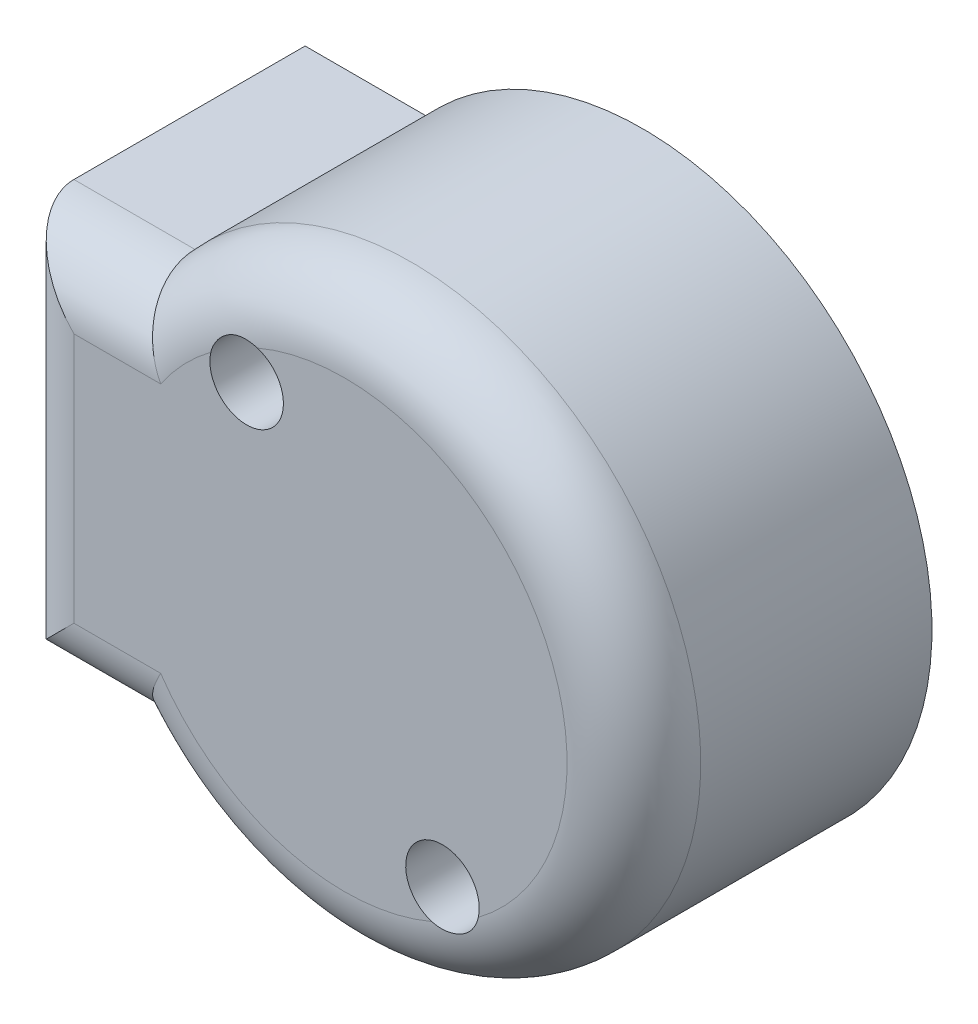
ISO-10303-21;
HEADER;
FILE_DESCRIPTION(('STEP AP214'),'2;1');
FILE_NAME('part.step','',(''),(''),'','','');
FILE_SCHEMA(('AUTOMOTIVE_DESIGN { 1 0 10303 214 1 1 1 1 }'));
ENDSEC;
DATA;
#1=APPLICATION_CONTEXT('core data for automotive mechanical design processes');
#2=APPLICATION_PROTOCOL_DEFINITION('international standard','automotive_design',2000,#1);
#3=PRODUCT_CONTEXT('',#1,'mechanical');
#4=PRODUCT('Part','Part','',(#3));
#5=PRODUCT_RELATED_PRODUCT_CATEGORY('part','',(#4));
#6=PRODUCT_DEFINITION_FORMATION('','',#4);
#7=PRODUCT_DEFINITION_CONTEXT('part definition',#1,'design');
#8=PRODUCT_DEFINITION('design','',#6,#7);
#9=PRODUCT_DEFINITION_SHAPE('','',#8);
#10=(LENGTH_UNIT() NAMED_UNIT(*) SI_UNIT(.MILLI.,.METRE.));
#11=(NAMED_UNIT(*) PLANE_ANGLE_UNIT() SI_UNIT($,.RADIAN.));
#12=(NAMED_UNIT(*) SI_UNIT($,.STERADIAN.) SOLID_ANGLE_UNIT());
#13=UNCERTAINTY_MEASURE_WITH_UNIT(LENGTH_MEASURE(1.E-05),#10,'distance_accuracy_value','');
#14=(GEOMETRIC_REPRESENTATION_CONTEXT(3) GLOBAL_UNCERTAINTY_ASSIGNED_CONTEXT((#13)) GLOBAL_UNIT_ASSIGNED_CONTEXT((#10,
#11,#12)) REPRESENTATION_CONTEXT('',''));
#15=CARTESIAN_POINT('',(0.,0.,0.));
#16=DIRECTION('',(0.,0.,1.));
#17=DIRECTION('',(1.,0.,0.));
#18=AXIS2_PLACEMENT_3D('',#15,#16,#17);
#19=CARTESIAN_POINT('',(0.,0.,11.3284));
#20=DIRECTION('',(0.,0.,-1.));
#21=DIRECTION('',(-1.,0.,0.));
#22=AXIS2_PLACEMENT_3D('',#19,#20,#21);
#23=CYLINDRICAL_SURFACE('',#22,10.9982);
#24=DIRECTION('',(0.,0.,-1.));
#25=VECTOR('',#24,1.);
#26=CARTESIAN_POINT('',(-8.22398303682589,7.3025,11.3284));
#27=LINE('',#26,#25);
#28=CARTESIAN_POINT('',(-8.22398303682589,7.3025,0.));
#29=VERTEX_POINT('',#28);
#30=CARTESIAN_POINT('',(-8.22398303682589,7.3025,8.7884));
#31=VERTEX_POINT('',#30);
#32=EDGE_CURVE('E130',#29,#31,#27,.F.);
#33=ORIENTED_EDGE('',*,*,#32,.T.);
#34=CARTESIAN_POINT('',(0.,0.,8.7884));
#35=DIRECTION('',(0.,0.,1.));
#36=DIRECTION('',(1.,0.,0.));
#37=AXIS2_PLACEMENT_3D('',#34,#35,#36);
#38=CIRCLE('',#37,10.9982);
#39=CARTESIAN_POINT('',(-8.22398303682589,-7.3025,8.7884));
#40=VERTEX_POINT('',#39);
#41=EDGE_CURVE('E11',#31,#40,#38,.F.);
#42=ORIENTED_EDGE('',*,*,#41,.T.);
#43=DIRECTION('',(0.,0.,-1.));
#44=VECTOR('',#43,1.);
#45=CARTESIAN_POINT('',(-8.22398303682589,-7.3025,11.3284));
#46=LINE('',#45,#44);
#47=CARTESIAN_POINT('',(-8.22398303682589,-7.3025,0.));
#48=VERTEX_POINT('',#47);
#49=EDGE_CURVE('E111',#40,#48,#46,.T.);
#50=ORIENTED_EDGE('',*,*,#49,.T.);
#51=CARTESIAN_POINT('',(0.,0.,0.));
#52=DIRECTION('',(0.,0.,1.));
#53=DIRECTION('',(1.,0.,0.));
#54=AXIS2_PLACEMENT_3D('',#51,#52,#53);
#55=CIRCLE('',#54,10.9982);
#56=EDGE_CURVE('E107',#48,#29,#55,.T.);
#57=ORIENTED_EDGE('',*,*,#56,.T.);
#58=EDGE_LOOP('',(#33,#42,#50,#57));
#59=FACE_BOUND('',#58,.T.);
#60=ADVANCED_FACE('F32',(#59),#23,.T.);
#61=CARTESIAN_POINT('',(0.,0.,11.3284));
#62=DIRECTION('',(0.,0.,1.));
#63=DIRECTION('',(1.,0.,0.));
#64=AXIS2_PLACEMENT_3D('',#61,#62,#63);
#65=PLANE('',#64);
#66=CARTESIAN_POINT('',(3.72109999999999,-6.44513426004456,11.3284));
#67=DIRECTION('',(0.,0.,1.));
#68=DIRECTION('',(1.,0.,0.));
#69=AXIS2_PLACEMENT_3D('',#66,#67,#68);
#70=CIRCLE('',#69,1.397);
#71=CARTESIAN_POINT('',(5.08183737710488,-6.76136643827709,11.3284));
#72=VERTEX_POINT('',#71);
#73=CARTESIAN_POINT('',(3.31459641129099,-7.78168348561266,11.3284));
#74=VERTEX_POINT('',#73);
#75=EDGE_CURVE('E243',#72,#74,#70,.T.);
#76=ORIENTED_EDGE('',*,*,#75,.F.);
#77=CARTESIAN_POINT('',(0.,0.,11.3284));
#78=DIRECTION('',(0.,0.,1.));
#79=DIRECTION('',(1.,0.,0.));
#80=AXIS2_PLACEMENT_3D('',#77,#78,#79);
#81=CIRCLE('',#80,8.4582);
#82=CARTESIAN_POINT('',(-3.31459641129099,7.78168348561266,11.3284));
#83=VERTEX_POINT('',#82);
#84=EDGE_CURVE('E144',#72,#83,#81,.T.);
#85=ORIENTED_EDGE('',*,*,#84,.T.);
#86=CARTESIAN_POINT('',(-3.72109999999999,6.44513426004456,11.3284));
#87=DIRECTION('',(0.,0.,1.));
#88=DIRECTION('',(1.,0.,0.));
#89=AXIS2_PLACEMENT_3D('',#86,#87,#88);
#90=CIRCLE('',#89,1.397);
#91=CARTESIAN_POINT('',(-5.08183737710488,6.76136643827709,11.3284));
#92=VERTEX_POINT('',#91);
#93=EDGE_CURVE('E126',#92,#83,#90,.T.);
#94=ORIENTED_EDGE('',*,*,#93,.F.);
#95=CARTESIAN_POINT('',(0.,0.,11.3284));
#96=DIRECTION('',(0.,0.,1.));
#97=DIRECTION('',(1.,0.,0.));
#98=AXIS2_PLACEMENT_3D('',#95,#96,#97);
#99=CIRCLE('',#98,8.4582);
#100=CARTESIAN_POINT('',(-6.98997431969532,4.7625,11.3284));
#101=VERTEX_POINT('',#100);
#102=EDGE_CURVE('E133',#92,#101,#99,.T.);
#103=ORIENTED_EDGE('',*,*,#102,.T.);
#104=DIRECTION('',(-1.,0.,0.));
#105=VECTOR('',#104,1.);
#106=CARTESIAN_POINT('',(0.,4.7625,11.3284));
#107=LINE('',#106,#105);
#108=CARTESIAN_POINT('',(-10.287,4.7625,11.3284));
#109=VERTEX_POINT('',#108);
#110=EDGE_CURVE('E135',#101,#109,#107,.T.);
#111=ORIENTED_EDGE('',*,*,#110,.T.);
#112=DIRECTION('',(0.,-1.,0.));
#113=VECTOR('',#112,1.);
#114=CARTESIAN_POINT('',(-10.287,0.,11.3284));
#115=LINE('',#114,#113);
#116=CARTESIAN_POINT('',(-10.287,-4.7625,11.3284));
#117=VERTEX_POINT('',#116);
#118=EDGE_CURVE('E137',#109,#117,#115,.T.);
#119=ORIENTED_EDGE('',*,*,#118,.T.);
#120=DIRECTION('',(1.,0.,0.));
#121=VECTOR('',#120,1.);
#122=CARTESIAN_POINT('',(0.,-4.7625,11.3284));
#123=LINE('',#122,#121);
#124=CARTESIAN_POINT('',(-6.98997431969532,-4.7625,11.3284));
#125=VERTEX_POINT('',#124);
#126=EDGE_CURVE('E139',#117,#125,#123,.T.);
#127=ORIENTED_EDGE('',*,*,#126,.T.);
#128=CARTESIAN_POINT('',(0.,0.,11.3284));
#129=DIRECTION('',(0.,0.,1.));
#130=DIRECTION('',(1.,0.,0.));
#131=AXIS2_PLACEMENT_3D('',#128,#129,#130);
#132=CIRCLE('',#131,8.4582);
#133=EDGE_CURVE('E142',#125,#74,#132,.T.);
#134=ORIENTED_EDGE('',*,*,#133,.T.);
#135=EDGE_LOOP('',(#76,#85,#94,#103,#111,#119,#127,#134));
#136=FACE_BOUND('',#135,.T.);
#137=ADVANCED_FACE('F180',(#136),#65,.T.);
#138=CARTESIAN_POINT('',(0.,0.,0.));
#139=DIRECTION('',(0.,0.,1.));
#140=DIRECTION('',(1.,0.,0.));
#141=AXIS2_PLACEMENT_3D('',#138,#139,#140);
#142=PLANE('',#141);
#143=CARTESIAN_POINT('',(-3.72109999999999,6.44513426004456,0.));
#144=DIRECTION('',(0.,0.,1.));
#145=DIRECTION('',(1.,0.,0.));
#146=AXIS2_PLACEMENT_3D('',#143,#144,#145);
#147=CIRCLE('',#146,1.397);
#148=CARTESIAN_POINT('',(-2.32409999999999,6.44513426004456,0.));
#149=VERTEX_POINT('',#148);
#150=EDGE_CURVE('E122',#149,#149,#147,.F.);
#151=ORIENTED_EDGE('',*,*,#150,.F.);
#152=EDGE_LOOP('',(#151));
#153=FACE_BOUND('',#152,.T.);
#154=CARTESIAN_POINT('',(3.72109999999999,-6.44513426004456,0.));
#155=DIRECTION('',(0.,0.,1.));
#156=DIRECTION('',(1.,0.,0.));
#157=AXIS2_PLACEMENT_3D('',#154,#155,#156);
#158=CIRCLE('',#157,1.397);
#159=CARTESIAN_POINT('',(5.11809999999999,-6.44513426004456,0.));
#160=VERTEX_POINT('',#159);
#161=EDGE_CURVE('E237',#160,#160,#158,.F.);
#162=ORIENTED_EDGE('',*,*,#161,.F.);
#163=EDGE_LOOP('',(#162));
#164=FACE_BOUND('',#163,.T.);
#165=ORIENTED_EDGE('',*,*,#56,.F.);
#166=DIRECTION('',(-1.,0.,0.));
#167=VECTOR('',#166,1.);
#168=CARTESIAN_POINT('',(-12.827,-7.3025,0.));
#169=LINE('',#168,#167);
#170=CARTESIAN_POINT('',(-12.827,-7.3025,0.));
#171=VERTEX_POINT('',#170);
#172=EDGE_CURVE('E101',#48,#171,#169,.T.);
#173=ORIENTED_EDGE('',*,*,#172,.T.);
#174=DIRECTION('',(0.,1.,0.));
#175=VECTOR('',#174,1.);
#176=CARTESIAN_POINT('',(-12.827,7.3025,0.));
#177=LINE('',#176,#175);
#178=CARTESIAN_POINT('',(-12.827,7.3025,0.));
#179=VERTEX_POINT('',#178);
#180=EDGE_CURVE('E105',#171,#179,#177,.T.);
#181=ORIENTED_EDGE('',*,*,#180,.T.);
#182=DIRECTION('',(1.,0.,0.));
#183=VECTOR('',#182,1.);
#184=CARTESIAN_POINT('',(-12.827,7.3025,0.));
#185=LINE('',#184,#183);
#186=EDGE_CURVE('E116',#179,#29,#185,.T.);
#187=ORIENTED_EDGE('',*,*,#186,.T.);
#188=EDGE_LOOP('',(#165,#173,#181,#187));
#189=FACE_BOUND('',#188,.T.);
#190=ADVANCED_FACE('F103',(#153,#164,#189),#142,.F.);
#191=CARTESIAN_POINT('',(-12.827,7.3025,-18.2016148109216));
#192=DIRECTION('',(0.,1.,0.));
#193=DIRECTION('',(0.,0.,1.));
#194=AXIS2_PLACEMENT_3D('',#191,#192,#193);
#195=PLANE('',#194);
#196=DIRECTION('',(0.,0.,1.));
#197=VECTOR('',#196,1.);
#198=CARTESIAN_POINT('',(-12.827,7.3025,-18.2016148109216));
#199=LINE('',#198,#197);
#200=CARTESIAN_POINT('',(-12.827,7.3025,8.7884));
#201=VERTEX_POINT('',#200);
#202=EDGE_CURVE('E115',#179,#201,#199,.T.);
#203=ORIENTED_EDGE('',*,*,#202,.T.);
#204=DIRECTION('',(-1.,0.,0.));
#205=VECTOR('',#204,1.);
#206=CARTESIAN_POINT('',(-12.827,7.3025,8.7884));
#207=LINE('',#206,#205);
#208=EDGE_CURVE('E49',#201,#31,#207,.F.);
#209=ORIENTED_EDGE('',*,*,#208,.T.);
#210=ORIENTED_EDGE('',*,*,#32,.F.);
#211=ORIENTED_EDGE('',*,*,#186,.F.);
#212=EDGE_LOOP('',(#203,#209,#210,#211));
#213=FACE_BOUND('',#212,.T.);
#214=ADVANCED_FACE('F173',(#213),#195,.T.);
#215=CARTESIAN_POINT('',(-12.827,-7.3025,-18.2016148109216));
#216=DIRECTION('',(0.,-1.,0.));
#217=DIRECTION('',(0.,0.,-1.));
#218=AXIS2_PLACEMENT_3D('',#215,#216,#217);
#219=PLANE('',#218);
#220=ORIENTED_EDGE('',*,*,#49,.F.);
#221=DIRECTION('',(1.,0.,0.));
#222=VECTOR('',#221,1.);
#223=CARTESIAN_POINT('',(-12.827,-7.3025,8.7884));
#224=LINE('',#223,#222);
#225=CARTESIAN_POINT('',(-12.827,-7.3025,8.7884));
#226=VERTEX_POINT('',#225);
#227=EDGE_CURVE('E121',#40,#226,#224,.F.);
#228=ORIENTED_EDGE('',*,*,#227,.T.);
#229=DIRECTION('',(0.,0.,1.));
#230=VECTOR('',#229,1.);
#231=CARTESIAN_POINT('',(-12.827,-7.3025,-18.2016148109216));
#232=LINE('',#231,#230);
#233=EDGE_CURVE('E114',#171,#226,#232,.T.);
#234=ORIENTED_EDGE('',*,*,#233,.F.);
#235=ORIENTED_EDGE('',*,*,#172,.F.);
#236=EDGE_LOOP('',(#220,#228,#234,#235));
#237=FACE_BOUND('',#236,.T.);
#238=ADVANCED_FACE('F119',(#237),#219,.T.);
#239=CARTESIAN_POINT('',(-12.827,7.3025,-18.2016148109216));
#240=DIRECTION('',(-1.,0.,0.));
#241=DIRECTION('',(0.,0.,1.));
#242=AXIS2_PLACEMENT_3D('',#239,#240,#241);
#243=PLANE('',#242);
#244=ORIENTED_EDGE('',*,*,#233,.T.);
#245=DIRECTION('',(0.,-1.,0.));
#246=VECTOR('',#245,1.);
#247=CARTESIAN_POINT('',(-12.827,7.3025,8.7884));
#248=LINE('',#247,#246);
#249=EDGE_CURVE('E57',#226,#201,#248,.F.);
#250=ORIENTED_EDGE('',*,*,#249,.T.);
#251=ORIENTED_EDGE('',*,*,#202,.F.);
#252=ORIENTED_EDGE('',*,*,#180,.F.);
#253=EDGE_LOOP('',(#244,#250,#251,#252));
#254=FACE_BOUND('',#253,.T.);
#255=ADVANCED_FACE('F113',(#254),#243,.T.);
#256=CARTESIAN_POINT('',(3.72109999999999,-6.44513426004456,-3.95131269327043));
#257=DIRECTION('',(0.,0.,1.));
#258=DIRECTION('',(1.,0.,0.));
#259=AXIS2_PLACEMENT_3D('',#256,#257,#258);
#260=CYLINDRICAL_SURFACE('',#259,1.397);
#261=ORIENTED_EDGE('',*,*,#161,.T.);
#262=EDGE_LOOP('',(#261));
#263=FACE_BOUND('',#262,.T.);
#264=ORIENTED_EDGE('',*,*,#75,.T.);
#265=CARTESIAN_POINT('',(3.31459641129099,-7.78168348561266,11.3284));
#266=CARTESIAN_POINT('',(3.35211511287611,-7.79309462369248,11.3283987059731));
#267=CARTESIAN_POINT('',(3.39009370733963,-7.80291861358623,11.3280251264078));
#268=CARTESIAN_POINT('',(3.46672661205109,-7.81933940668995,11.3267221315584));
#269=CARTESIAN_POINT('',(3.50538080681683,-7.8259367559574,11.325792810384));
#270=CARTESIAN_POINT('',(3.62188614683377,-7.84079871670511,11.322457554141));
#271=CARTESIAN_POINT('',(3.70040122349009,-7.84416994455899,11.3195031172027));
#272=CARTESIAN_POINT('',(3.85685110650962,-7.83772873789468,11.3134668989169));
#273=CARTESIAN_POINT('',(3.93478584438002,-7.82791477127377,11.3103851028109));
#274=CARTESIAN_POINT('',(4.08794223128569,-7.79537829232899,11.305123575423));
#275=CARTESIAN_POINT('',(4.16316443378942,-7.77265842936869,11.3029436591592));
#276=CARTESIAN_POINT('',(4.30891433643998,-7.71487514197567,11.3001217956357));
#277=CARTESIAN_POINT('',(4.37943237262151,-7.67978718490172,11.299482925005));
#278=CARTESIAN_POINT('',(4.51358429154207,-7.59827676338437,11.2999313424523));
#279=CARTESIAN_POINT('',(4.57721763523367,-7.55185341234457,11.3010187655885));
#280=CARTESIAN_POINT('',(4.69538069905781,-7.44935759433355,11.30460098264));
#281=CARTESIAN_POINT('',(4.74996722390015,-7.39335020418431,11.3070865277795));
#282=CARTESIAN_POINT('',(4.84903596005899,-7.2730478229178,11.3127166356843));
#283=CARTESIAN_POINT('',(4.89351929586421,-7.20875375536064,11.3158611250337));
#284=CARTESIAN_POINT('',(4.96634748630017,-7.08202080534204,11.3213491805445));
#285=CARTESIAN_POINT('',(4.99600780982768,-7.02033572178945,11.3237437040438));
#286=CARTESIAN_POINT('',(5.04603505504344,-6.89328663294274,11.327259877032));
#287=CARTESIAN_POINT('',(5.06640336503408,-6.8279231788675,11.3283817167073));
#288=CARTESIAN_POINT('',(5.08183737710488,-6.76136643827709,11.3284));
#289=B_SPLINE_CURVE_WITH_KNOTS('',3,(#265,#266,#267,#268,#269,#270,#271,#272,#273,#274,#275,
#276,#277,#278,#279,#280,#281,#282,#283,#284,#285,#286,#287,#288),.UNSPECIFIED.,.F.,.F.,(4,2,2,
2,2,2,2,2,2,2,2,4),(0.,0.117568877987213,0.235117852425724,0.469840840117009,0.704591104677994,
0.93929319636206,1.17446347392957,1.40965215120558,1.64330301550522,1.87692786161837,
2.08166200462881,2.28636554866735),.UNSPECIFIED.);
#290=EDGE_CURVE('E149',#74,#72,#289,.T.);
#291=ORIENTED_EDGE('',*,*,#290,.T.);
#292=EDGE_LOOP('',(#264,#291));
#293=FACE_BOUND('',#292,.T.);
#294=ADVANCED_FACE('F166',(#263,#293),#260,.F.);
#295=CARTESIAN_POINT('',(-3.72109999999999,6.44513426004456,-3.95131269327043));
#296=DIRECTION('',(0.,0.,1.));
#297=DIRECTION('',(1.,0.,0.));
#298=AXIS2_PLACEMENT_3D('',#295,#296,#297);
#299=CYLINDRICAL_SURFACE('',#298,1.397);
#300=ORIENTED_EDGE('',*,*,#150,.T.);
#301=EDGE_LOOP('',(#300));
#302=FACE_BOUND('',#301,.T.);
#303=ORIENTED_EDGE('',*,*,#93,.T.);
#304=CARTESIAN_POINT('',(-3.31459641129099,7.78168348561266,11.3284));
#305=CARTESIAN_POINT('',(-3.3521151128761,7.79309462369248,11.3283987059731));
#306=CARTESIAN_POINT('',(-3.39009370733963,7.80291861358623,11.3280251264078));
#307=CARTESIAN_POINT('',(-3.46672661205109,7.81933940668995,11.3267221315584));
#308=CARTESIAN_POINT('',(-3.50538080681683,7.8259367559574,11.325792810384));
#309=CARTESIAN_POINT('',(-3.62188614683377,7.84079871670511,11.322457554141));
#310=CARTESIAN_POINT('',(-3.70040122349009,7.84416994455899,11.3195031172027));
#311=CARTESIAN_POINT('',(-3.85685110650962,7.83772873789468,11.3134668989169));
#312=CARTESIAN_POINT('',(-3.93478584438002,7.82791477127377,11.3103851028109));
#313=CARTESIAN_POINT('',(-4.08794223128569,7.79537829232899,11.305123575423));
#314=CARTESIAN_POINT('',(-4.16316443378942,7.77265842936869,11.3029436591592));
#315=CARTESIAN_POINT('',(-4.30891433643998,7.71487514197567,11.3001217956357));
#316=CARTESIAN_POINT('',(-4.3794323726215,7.67978718490172,11.299482925005));
#317=CARTESIAN_POINT('',(-4.51358429154207,7.59827676338437,11.2999313424523));
#318=CARTESIAN_POINT('',(-4.57721763523367,7.55185341234457,11.3010187655885));
#319=CARTESIAN_POINT('',(-4.69538069905781,7.44935759433355,11.30460098264));
#320=CARTESIAN_POINT('',(-4.74996722390015,7.39335020418431,11.3070865277795));
#321=CARTESIAN_POINT('',(-4.84903596005899,7.2730478229178,11.3127166356843));
#322=CARTESIAN_POINT('',(-4.89351929586421,7.20875375536064,11.3158611250337));
#323=CARTESIAN_POINT('',(-4.96634748630017,7.08202080534204,11.3213491805445));
#324=CARTESIAN_POINT('',(-4.99600780982768,7.02033572178945,11.3237437040438));
#325=CARTESIAN_POINT('',(-5.04603505504344,6.89328663294274,11.327259877032));
#326=CARTESIAN_POINT('',(-5.06640336503408,6.8279231788675,11.3283817167073));
#327=CARTESIAN_POINT('',(-5.08183737710488,6.76136643827709,11.3284));
#328=B_SPLINE_CURVE_WITH_KNOTS('',3,(#304,#305,#306,#307,#308,#309,#310,#311,#312,#313,#314,
#315,#316,#317,#318,#319,#320,#321,#322,#323,#324,#325,#326,#327),.UNSPECIFIED.,.F.,.F.,(4,2,2,
2,2,2,2,2,2,2,2,4),(0.,0.117568877987213,0.235117852425724,0.469840840117009,0.704591104677993,
0.93929319636206,1.17446347392957,1.40965215120558,1.64330301550522,1.87692786161837,
2.08166200462881,2.28636554866735),.UNSPECIFIED.);
#329=EDGE_CURVE('E41',#83,#92,#328,.T.);
#330=ORIENTED_EDGE('',*,*,#329,.T.);
#331=EDGE_LOOP('',(#303,#330));
#332=FACE_BOUND('',#331,.T.);
#333=ADVANCED_FACE('F170',(#302,#332),#299,.F.);
#334=CARTESIAN_POINT('',(0.,4.7625,8.7884));
#335=DIRECTION('',(-1.,0.,0.));
#336=DIRECTION('',(0.,0.,1.));
#337=AXIS2_PLACEMENT_3D('',#334,#335,#336);
#338=CYLINDRICAL_SURFACE('',#337,2.54);
#339=CARTESIAN_POINT('',(-8.22398303682589,7.3025,8.7884));
#340=CARTESIAN_POINT('',(-8.22398633368581,7.30250970596842,8.85516050099666));
#341=CARTESIAN_POINT('',(-8.22280029849334,7.29986813157653,8.92191605761331));
#342=CARTESIAN_POINT('',(-8.21807521133016,7.28935674912622,9.05491689499441));
#343=CARTESIAN_POINT('',(-8.21453665016304,7.28148803159829,9.1211622792797));
#344=CARTESIAN_POINT('',(-8.20514564874067,7.26062664425507,9.25248171958893));
#345=CARTESIAN_POINT('',(-8.19929988571197,7.2476487610449,9.31755859412373));
#346=CARTESIAN_POINT('',(-8.18534885424786,7.21672337218336,9.44625569801211));
#347=CARTESIAN_POINT('',(-8.17724354431512,7.19877577526157,9.50987590059019));
#348=CARTESIAN_POINT('',(-8.14963194395664,7.13774907685583,9.69784830048646));
#349=CARTESIAN_POINT('',(-8.12681844320065,7.08746024129467,9.81947214488033));
#350=CARTESIAN_POINT('',(-8.07309032654978,6.96970417896107,10.0520796281777));
#351=CARTESIAN_POINT('',(-8.04217244390593,6.90223002536861,10.1630589517466));
#352=CARTESIAN_POINT('',(-7.97195782719239,6.75009384388993,10.3754321873471));
#353=CARTESIAN_POINT('',(-7.93242136375335,6.66494433150454,10.4763971571493));
#354=CARTESIAN_POINT('',(-7.84664422105208,6.4818287269852,10.6625875548854));
#355=CARTESIAN_POINT('',(-7.80040175381526,6.38385921742803,10.7478087713501));
#356=CARTESIAN_POINT('',(-7.69820994999519,6.16952410995506,10.90764368223));
#357=CARTESIAN_POINT('',(-7.64177466579351,6.05230778097954,10.9808037763461));
#358=CARTESIAN_POINT('',(-7.52355134604534,5.80974264838412,11.1064945675343));
#359=CARTESIAN_POINT('',(-7.46175966611645,5.68438832262996,11.1590110825248));
#360=CARTESIAN_POINT('',(-7.33401348809756,5.42866936960041,11.2431876436008));
#361=CARTESIAN_POINT('',(-7.26805194147509,5.29829641283402,11.2748112814164));
#362=CARTESIAN_POINT('',(-7.13335321705175,5.03585385223103,11.3171333810788));
#363=CARTESIAN_POINT('',(-7.06462178767456,4.90378811455498,11.3278731102359));
#364=CARTESIAN_POINT('',(-6.99342879441355,4.76903492820485,11.3283937085359));
#365=CARTESIAN_POINT('',(-6.99170177859961,4.76576727284247,11.3284000133182));
#366=CARTESIAN_POINT('',(-6.98997431969532,4.7625,11.3284));
#367=B_SPLINE_CURVE_WITH_KNOTS('',3,(#339,#340,#341,#342,#343,#344,#345,#346,#347,#348,#349,
#350,#351,#352,#353,#354,#355,#356,#357,#358,#359,#360,#361,#362,#363,#364,#365,#366),
.UNSPECIFIED.,.F.,.F.,(4,2,2,2,2,2,2,2,2,2,2,2,2,4),(0.,0.200210285146211,0.400378813854027,
0.599972237437937,0.799569326863629,1.19828266016971,1.59715695635729,2.00899928366175,
2.4209516201646,2.86686401522777,3.31308221771127,3.76007597062056,4.20618554755557,
4.21727343161496),.UNSPECIFIED.);
#368=EDGE_CURVE('E196',#31,#101,#367,.T.);
#369=ORIENTED_EDGE('',*,*,#368,.F.);
#370=ORIENTED_EDGE('',*,*,#208,.F.);
#371=CARTESIAN_POINT('',(-10.287,4.7625,8.7884));
#372=DIRECTION('',(-0.707106781186547,-0.707106781186547,0.));
#373=DIRECTION('',(-0.707106781186547,0.707106781186547,0.));
#374=AXIS2_PLACEMENT_3D('',#371,#372,#373);
#375=ELLIPSE('',#374,3.59210244842766,2.54);
#376=EDGE_CURVE('E36',#109,#201,#375,.T.);
#377=ORIENTED_EDGE('',*,*,#376,.F.);
#378=ORIENTED_EDGE('',*,*,#110,.F.);
#379=EDGE_LOOP('',(#369,#370,#377,#378));
#380=FACE_BOUND('',#379,.T.);
#381=ADVANCED_FACE('F197',(#380),#338,.T.);
#382=CARTESIAN_POINT('',(-10.287,0.,8.7884));
#383=DIRECTION('',(0.,-1.,0.));
#384=DIRECTION('',(0.,0.,-1.));
#385=AXIS2_PLACEMENT_3D('',#382,#383,#384);
#386=CYLINDRICAL_SURFACE('',#385,2.54);
#387=ORIENTED_EDGE('',*,*,#376,.T.);
#388=ORIENTED_EDGE('',*,*,#249,.F.);
#389=CARTESIAN_POINT('',(-10.287,-4.7625,8.7884));
#390=DIRECTION('',(0.707106781186547,-0.707106781186547,0.));
#391=DIRECTION('',(-0.707106781186547,-0.707106781186547,0.));
#392=AXIS2_PLACEMENT_3D('',#389,#390,#391);
#393=ELLIPSE('',#392,3.59210244842766,2.54);
#394=EDGE_CURVE('E202',#117,#226,#393,.T.);
#395=ORIENTED_EDGE('',*,*,#394,.F.);
#396=ORIENTED_EDGE('',*,*,#118,.F.);
#397=EDGE_LOOP('',(#387,#388,#395,#396));
#398=FACE_BOUND('',#397,.T.);
#399=ADVANCED_FACE('F34',(#398),#386,.T.);
#400=CARTESIAN_POINT('',(0.,0.,8.7884));
#401=DIRECTION('',(0.,0.,1.));
#402=DIRECTION('',(1.,0.,0.));
#403=AXIS2_PLACEMENT_3D('',#400,#401,#402);
#404=TOROIDAL_SURFACE('',#403,8.4582,2.54);
#405=ORIENTED_EDGE('',*,*,#290,.F.);
#406=ORIENTED_EDGE('',*,*,#133,.F.);
#407=CARTESIAN_POINT('',(-8.22398303682589,-7.3025,8.7884));
#408=CARTESIAN_POINT('',(-8.22398633368581,-7.30250970596842,8.85516050099666));
#409=CARTESIAN_POINT('',(-8.22280029849334,-7.29986813157653,8.92191605761331));
#410=CARTESIAN_POINT('',(-8.21807521133016,-7.28935674912622,9.05491689499441));
#411=CARTESIAN_POINT('',(-8.21453665016304,-7.28148803159829,9.1211622792797));
#412=CARTESIAN_POINT('',(-8.20514564874067,-7.26062664425507,9.25248171958893));
#413=CARTESIAN_POINT('',(-8.19929988571197,-7.2476487610449,9.31755859412373));
#414=CARTESIAN_POINT('',(-8.18534885424786,-7.21672337218336,9.44625569801211));
#415=CARTESIAN_POINT('',(-8.17724354431512,-7.19877577526157,9.50987590059019));
#416=CARTESIAN_POINT('',(-8.14963194395664,-7.13774907685583,9.69784830048646));
#417=CARTESIAN_POINT('',(-8.12681844320065,-7.08746024129467,9.81947214488033));
#418=CARTESIAN_POINT('',(-8.07309032654978,-6.96970417896107,10.0520796281777));
#419=CARTESIAN_POINT('',(-8.04217244390593,-6.90223002536861,10.1630589517466));
#420=CARTESIAN_POINT('',(-7.97195782719239,-6.75009384388993,10.3754321873471));
#421=CARTESIAN_POINT('',(-7.93242136375335,-6.66494433150454,10.4763971571493));
#422=CARTESIAN_POINT('',(-7.84664422105208,-6.4818287269852,10.6625875548854));
#423=CARTESIAN_POINT('',(-7.80040175381526,-6.38385921742803,10.7478087713501));
#424=CARTESIAN_POINT('',(-7.69820994999519,-6.16952410995506,10.90764368223));
#425=CARTESIAN_POINT('',(-7.64177466579351,-6.05230778097954,10.9808037763461));
#426=CARTESIAN_POINT('',(-7.52355134604534,-5.80974264838412,11.1064945675343));
#427=CARTESIAN_POINT('',(-7.46175966611645,-5.68438832262996,11.1590110825248));
#428=CARTESIAN_POINT('',(-7.33401348809756,-5.42866936960041,11.2431876436008));
#429=CARTESIAN_POINT('',(-7.26805194147509,-5.29829641283402,11.2748112814164));
#430=CARTESIAN_POINT('',(-7.13335321705175,-5.03585385223103,11.3171333810788));
#431=CARTESIAN_POINT('',(-7.06462178767456,-4.90378811455498,11.3278731102359));
#432=CARTESIAN_POINT('',(-6.99342879441355,-4.76903492820485,11.3283937085359));
#433=CARTESIAN_POINT('',(-6.99170177859961,-4.76576727284247,11.3284000133182));
#434=CARTESIAN_POINT('',(-6.98997431969532,-4.7625,11.3284));
#435=B_SPLINE_CURVE_WITH_KNOTS('',3,(#407,#408,#409,#410,#411,#412,#413,#414,#415,#416,#417,
#418,#419,#420,#421,#422,#423,#424,#425,#426,#427,#428,#429,#430,#431,#432,#433,#434),
.UNSPECIFIED.,.F.,.F.,(4,2,2,2,2,2,2,2,2,2,2,2,2,4),(0.,0.200210285146211,0.400378813854027,
0.599972237437937,0.799569326863629,1.19828266016971,1.59715695635729,2.00899928366175,
2.4209516201646,2.86686401522777,3.31308221771127,3.76007597062056,4.20618554755557,
4.21727343161496),.UNSPECIFIED.);
#436=EDGE_CURVE('E206',#40,#125,#435,.T.);
#437=ORIENTED_EDGE('',*,*,#436,.F.);
#438=ORIENTED_EDGE('',*,*,#41,.F.);
#439=ORIENTED_EDGE('',*,*,#368,.T.);
#440=ORIENTED_EDGE('',*,*,#102,.F.);
#441=ORIENTED_EDGE('',*,*,#329,.F.);
#442=ORIENTED_EDGE('',*,*,#84,.F.);
#443=EDGE_LOOP('',(#405,#406,#437,#438,#439,#440,#441,#442));
#444=FACE_BOUND('',#443,.T.);
#445=ADVANCED_FACE('F162',(#444),#404,.T.);
#446=CARTESIAN_POINT('',(0.,-4.7625,8.7884));
#447=DIRECTION('',(1.,0.,0.));
#448=DIRECTION('',(0.,0.,-1.));
#449=AXIS2_PLACEMENT_3D('',#446,#447,#448);
#450=CYLINDRICAL_SURFACE('',#449,2.54);
#451=ORIENTED_EDGE('',*,*,#394,.T.);
#452=ORIENTED_EDGE('',*,*,#227,.F.);
#453=ORIENTED_EDGE('',*,*,#436,.T.);
#454=ORIENTED_EDGE('',*,*,#126,.F.);
#455=EDGE_LOOP('',(#451,#452,#453,#454));
#456=FACE_BOUND('',#455,.T.);
#457=ADVANCED_FACE('F215',(#456),#450,.T.);
#458=CLOSED_SHELL('',(#60,#137,#190,#214,#238,#255,#294,#333,#381,#399,#445,#457));
#459=MANIFOLD_SOLID_BREP('B2',#458);
#460=ADVANCED_BREP_SHAPE_REPRESENTATION('',(#18,#459),#14);
#461=SHAPE_DEFINITION_REPRESENTATION(#9,#460);
ENDSEC;
END-ISO-10303-21;
